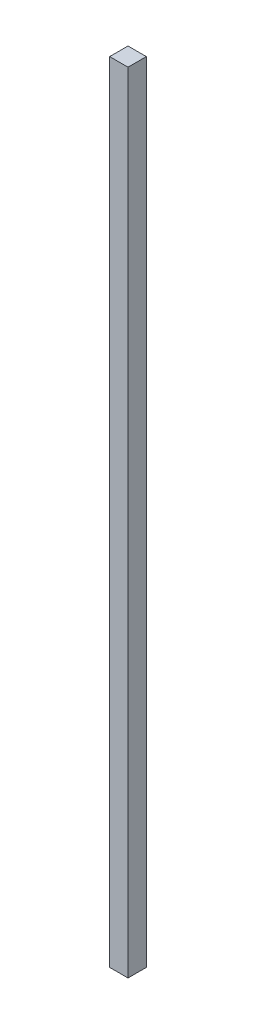
ISO-10303-21;
HEADER;
FILE_DESCRIPTION(('STEP AP214'),'2;1');
FILE_NAME('part.step','',(''),(''),'','','');
FILE_SCHEMA(('AUTOMOTIVE_DESIGN { 1 0 10303 214 1 1 1 1 }'));
ENDSEC;
DATA;
#1=APPLICATION_CONTEXT('core data for automotive mechanical design processes');
#2=APPLICATION_PROTOCOL_DEFINITION('international standard','automotive_design',2000,#1);
#3=PRODUCT_CONTEXT('',#1,'mechanical');
#4=PRODUCT('Part','Part','',(#3));
#5=PRODUCT_RELATED_PRODUCT_CATEGORY('part','',(#4));
#6=PRODUCT_DEFINITION_FORMATION('','',#4);
#7=PRODUCT_DEFINITION_CONTEXT('part definition',#1,'design');
#8=PRODUCT_DEFINITION('design','',#6,#7);
#9=PRODUCT_DEFINITION_SHAPE('','',#8);
#10=(LENGTH_UNIT() NAMED_UNIT(*) SI_UNIT(.MILLI.,.METRE.));
#11=(NAMED_UNIT(*) PLANE_ANGLE_UNIT() SI_UNIT($,.RADIAN.));
#12=(NAMED_UNIT(*) SI_UNIT($,.STERADIAN.) SOLID_ANGLE_UNIT());
#13=UNCERTAINTY_MEASURE_WITH_UNIT(LENGTH_MEASURE(1.E-05),#10,'distance_accuracy_value','');
#14=(GEOMETRIC_REPRESENTATION_CONTEXT(3) GLOBAL_UNCERTAINTY_ASSIGNED_CONTEXT((#13)) GLOBAL_UNIT_ASSIGNED_CONTEXT((#10,
#11,#12)) REPRESENTATION_CONTEXT('',''));
#15=CARTESIAN_POINT('',(0.,0.,0.));
#16=DIRECTION('',(0.,0.,1.));
#17=DIRECTION('',(1.,0.,0.));
#18=AXIS2_PLACEMENT_3D('',#15,#16,#17);
#19=CARTESIAN_POINT('',(0.,860.,0.));
#20=DIRECTION('',(1.,0.,0.));
#21=DIRECTION('',(0.,0.,-1.));
#22=AXIS2_PLACEMENT_3D('',#19,#20,#21);
#23=PLANE('',#22);
#24=DIRECTION('',(0.,0.,1.));
#25=VECTOR('',#24,1.);
#26=CARTESIAN_POINT('',(0.,0.,0.));
#27=LINE('',#26,#25);
#28=CARTESIAN_POINT('',(0.,0.,0.));
#29=VERTEX_POINT('',#28);
#30=CARTESIAN_POINT('',(0.,0.,20.));
#31=VERTEX_POINT('',#30);
#32=EDGE_CURVE('E95',#29,#31,#27,.T.);
#33=ORIENTED_EDGE('',*,*,#32,.T.);
#34=DIRECTION('',(0.,-1.,0.));
#35=VECTOR('',#34,1.);
#36=CARTESIAN_POINT('',(0.,860.,20.));
#37=LINE('',#36,#35);
#38=CARTESIAN_POINT('',(0.,860.,20.));
#39=VERTEX_POINT('',#38);
#40=EDGE_CURVE('E11',#39,#31,#37,.T.);
#41=ORIENTED_EDGE('',*,*,#40,.F.);
#42=DIRECTION('',(0.,0.,1.));
#43=VECTOR('',#42,1.);
#44=CARTESIAN_POINT('',(0.,860.,0.));
#45=LINE('',#44,#43);
#46=CARTESIAN_POINT('',(0.,860.,0.));
#47=VERTEX_POINT('',#46);
#48=EDGE_CURVE('E83',#47,#39,#45,.T.);
#49=ORIENTED_EDGE('',*,*,#48,.F.);
#50=DIRECTION('',(0.,-1.,0.));
#51=VECTOR('',#50,1.);
#52=CARTESIAN_POINT('',(0.,860.,0.));
#53=LINE('',#52,#51);
#54=EDGE_CURVE('E91',#47,#29,#53,.T.);
#55=ORIENTED_EDGE('',*,*,#54,.T.);
#56=EDGE_LOOP('',(#33,#41,#49,#55));
#57=FACE_BOUND('',#56,.T.);
#58=ADVANCED_FACE('F32',(#57),#23,.F.);
#59=CARTESIAN_POINT('',(0.,860.,20.));
#60=DIRECTION('',(0.,0.,-1.));
#61=DIRECTION('',(-1.,0.,0.));
#62=AXIS2_PLACEMENT_3D('',#59,#60,#61);
#63=PLANE('',#62);
#64=DIRECTION('',(1.,0.,0.));
#65=VECTOR('',#64,1.);
#66=CARTESIAN_POINT('',(0.,0.,20.));
#67=LINE('',#66,#65);
#68=CARTESIAN_POINT('',(20.,0.,20.));
#69=VERTEX_POINT('',#68);
#70=EDGE_CURVE('E87',#31,#69,#67,.T.);
#71=ORIENTED_EDGE('',*,*,#70,.T.);
#72=DIRECTION('',(0.,-1.,0.));
#73=VECTOR('',#72,1.);
#74=CARTESIAN_POINT('',(20.,860.,20.));
#75=LINE('',#74,#73);
#76=CARTESIAN_POINT('',(20.,860.,20.));
#77=VERTEX_POINT('',#76);
#78=EDGE_CURVE('E40',#77,#69,#75,.T.);
#79=ORIENTED_EDGE('',*,*,#78,.F.);
#80=DIRECTION('',(1.,0.,0.));
#81=VECTOR('',#80,1.);
#82=CARTESIAN_POINT('',(0.,860.,20.));
#83=LINE('',#82,#81);
#84=EDGE_CURVE('E78',#39,#77,#83,.T.);
#85=ORIENTED_EDGE('',*,*,#84,.F.);
#86=ORIENTED_EDGE('',*,*,#40,.T.);
#87=EDGE_LOOP('',(#71,#79,#85,#86));
#88=FACE_BOUND('',#87,.T.);
#89=ADVANCED_FACE('F86',(#88),#63,.F.);
#90=CARTESIAN_POINT('',(20.,860.,0.));
#91=DIRECTION('',(-1.,0.,0.));
#92=DIRECTION('',(0.,0.,1.));
#93=AXIS2_PLACEMENT_3D('',#90,#91,#92);
#94=PLANE('',#93);
#95=DIRECTION('',(0.,0.,-1.));
#96=VECTOR('',#95,1.);
#97=CARTESIAN_POINT('',(20.,0.,0.));
#98=LINE('',#97,#96);
#99=CARTESIAN_POINT('',(20.,0.,0.));
#100=VERTEX_POINT('',#99);
#101=EDGE_CURVE('E65',#69,#100,#98,.T.);
#102=ORIENTED_EDGE('',*,*,#101,.T.);
#103=DIRECTION('',(0.,-1.,0.));
#104=VECTOR('',#103,1.);
#105=CARTESIAN_POINT('',(20.,860.,0.));
#106=LINE('',#105,#104);
#107=CARTESIAN_POINT('',(20.,860.,0.));
#108=VERTEX_POINT('',#107);
#109=EDGE_CURVE('E88',#108,#100,#106,.T.);
#110=ORIENTED_EDGE('',*,*,#109,.F.);
#111=DIRECTION('',(0.,0.,-1.));
#112=VECTOR('',#111,1.);
#113=CARTESIAN_POINT('',(20.,860.,0.));
#114=LINE('',#113,#112);
#115=EDGE_CURVE('E81',#77,#108,#114,.T.);
#116=ORIENTED_EDGE('',*,*,#115,.F.);
#117=ORIENTED_EDGE('',*,*,#78,.T.);
#118=EDGE_LOOP('',(#102,#110,#116,#117));
#119=FACE_BOUND('',#118,.T.);
#120=ADVANCED_FACE('F89',(#119),#94,.F.);
#121=CARTESIAN_POINT('',(0.,860.,0.));
#122=DIRECTION('',(0.,0.,1.));
#123=DIRECTION('',(1.,0.,0.));
#124=AXIS2_PLACEMENT_3D('',#121,#122,#123);
#125=PLANE('',#124);
#126=DIRECTION('',(-1.,0.,0.));
#127=VECTOR('',#126,1.);
#128=CARTESIAN_POINT('',(0.,0.,0.));
#129=LINE('',#128,#127);
#130=EDGE_CURVE('E71',#100,#29,#129,.T.);
#131=ORIENTED_EDGE('',*,*,#130,.T.);
#132=ORIENTED_EDGE('',*,*,#54,.F.);
#133=DIRECTION('',(-1.,0.,0.));
#134=VECTOR('',#133,1.);
#135=CARTESIAN_POINT('',(0.,860.,0.));
#136=LINE('',#135,#134);
#137=EDGE_CURVE('E48',#108,#47,#136,.T.);
#138=ORIENTED_EDGE('',*,*,#137,.F.);
#139=ORIENTED_EDGE('',*,*,#109,.T.);
#140=EDGE_LOOP('',(#131,#132,#138,#139));
#141=FACE_BOUND('',#140,.T.);
#142=ADVANCED_FACE('F102',(#141),#125,.F.);
#143=CARTESIAN_POINT('',(0.,860.,0.));
#144=DIRECTION('',(0.,1.,0.));
#145=DIRECTION('',(0.,0.,1.));
#146=AXIS2_PLACEMENT_3D('',#143,#144,#145);
#147=PLANE('',#146);
#148=ORIENTED_EDGE('',*,*,#48,.T.);
#149=ORIENTED_EDGE('',*,*,#84,.T.);
#150=ORIENTED_EDGE('',*,*,#115,.T.);
#151=ORIENTED_EDGE('',*,*,#137,.T.);
#152=EDGE_LOOP('',(#148,#149,#150,#151));
#153=FACE_BOUND('',#152,.T.);
#154=ADVANCED_FACE('F79',(#153),#147,.T.);
#155=CARTESIAN_POINT('',(0.,0.,0.));
#156=DIRECTION('',(0.,1.,0.));
#157=DIRECTION('',(0.,0.,1.));
#158=AXIS2_PLACEMENT_3D('',#155,#156,#157);
#159=PLANE('',#158);
#160=ORIENTED_EDGE('',*,*,#32,.F.);
#161=ORIENTED_EDGE('',*,*,#130,.F.);
#162=ORIENTED_EDGE('',*,*,#101,.F.);
#163=ORIENTED_EDGE('',*,*,#70,.F.);
#164=EDGE_LOOP('',(#160,#161,#162,#163));
#165=FACE_BOUND('',#164,.T.);
#166=ADVANCED_FACE('F105',(#165),#159,.F.);
#167=CLOSED_SHELL('',(#58,#89,#120,#142,#154,#166));
#168=MANIFOLD_SOLID_BREP('B2',#167);
#169=ADVANCED_BREP_SHAPE_REPRESENTATION('',(#18,#168),#14);
#170=SHAPE_DEFINITION_REPRESENTATION(#9,#169);
ENDSEC;
END-ISO-10303-21;
